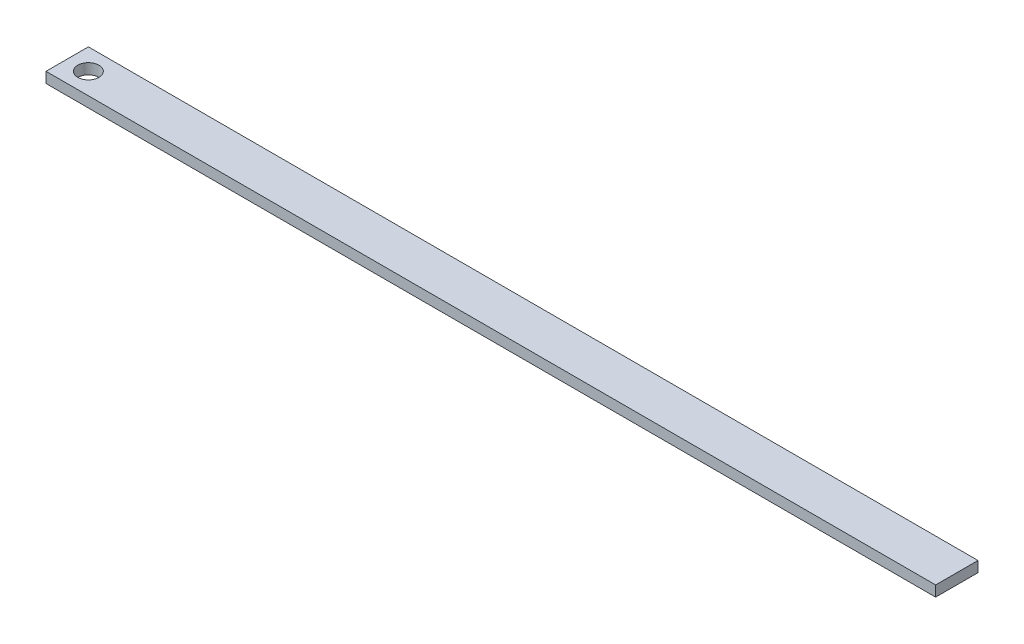
ISO-10303-21;
HEADER;
FILE_DESCRIPTION(('STEP AP214'),'2;1');
FILE_NAME('part.step','',(''),(''),'','','');
FILE_SCHEMA(('AUTOMOTIVE_DESIGN { 1 0 10303 214 1 1 1 1 }'));
ENDSEC;
DATA;
#1=APPLICATION_CONTEXT('core data for automotive mechanical design processes');
#2=APPLICATION_PROTOCOL_DEFINITION('international standard','automotive_design',2000,#1);
#3=PRODUCT_CONTEXT('',#1,'mechanical');
#4=PRODUCT('Part','Part','',(#3));
#5=PRODUCT_RELATED_PRODUCT_CATEGORY('part','',(#4));
#6=PRODUCT_DEFINITION_FORMATION('','',#4);
#7=PRODUCT_DEFINITION_CONTEXT('part definition',#1,'design');
#8=PRODUCT_DEFINITION('design','',#6,#7);
#9=PRODUCT_DEFINITION_SHAPE('','',#8);
#10=(LENGTH_UNIT() NAMED_UNIT(*) SI_UNIT(.MILLI.,.METRE.));
#11=(NAMED_UNIT(*) PLANE_ANGLE_UNIT() SI_UNIT($,.RADIAN.));
#12=(NAMED_UNIT(*) SI_UNIT($,.STERADIAN.) SOLID_ANGLE_UNIT());
#13=UNCERTAINTY_MEASURE_WITH_UNIT(LENGTH_MEASURE(1.E-05),#10,'distance_accuracy_value','');
#14=(GEOMETRIC_REPRESENTATION_CONTEXT(3) GLOBAL_UNCERTAINTY_ASSIGNED_CONTEXT((#13)) GLOBAL_UNIT_ASSIGNED_CONTEXT((#10,
#11,#12)) REPRESENTATION_CONTEXT('',''));
#15=CARTESIAN_POINT('',(0.,0.,0.));
#16=DIRECTION('',(0.,0.,1.));
#17=DIRECTION('',(1.,0.,0.));
#18=AXIS2_PLACEMENT_3D('',#15,#16,#17);
#19=CARTESIAN_POINT('',(10.5,0.25,0.499999999999996));
#20=DIRECTION('',(0.,1.,0.));
#21=DIRECTION('',(0.,0.,1.));
#22=AXIS2_PLACEMENT_3D('',#19,#20,#21);
#23=PLANE('',#22);
#24=DIRECTION('',(0.,0.,-1.));
#25=VECTOR('',#24,1.);
#26=CARTESIAN_POINT('',(10.5,0.25,-0.500000000000004));
#27=LINE('',#26,#25);
#28=CARTESIAN_POINT('',(10.5,0.25,0.499999999999996));
#29=VERTEX_POINT('',#28);
#30=CARTESIAN_POINT('',(10.5,0.25,-0.500000000000004));
#31=VERTEX_POINT('',#30);
#32=EDGE_CURVE('E90',#29,#31,#27,.T.);
#33=ORIENTED_EDGE('',*,*,#32,.T.);
#34=DIRECTION('',(-1.,0.,0.));
#35=VECTOR('',#34,1.);
#36=CARTESIAN_POINT('',(-10.5,0.25,-0.500000000000004));
#37=LINE('',#36,#35);
#38=CARTESIAN_POINT('',(-10.5,0.25,-0.500000000000004));
#39=VERTEX_POINT('',#38);
#40=EDGE_CURVE('E85',#31,#39,#37,.T.);
#41=ORIENTED_EDGE('',*,*,#40,.T.);
#42=DIRECTION('',(0.,0.,1.));
#43=VECTOR('',#42,1.);
#44=CARTESIAN_POINT('',(-10.5,0.25,-0.500000000000004));
#45=LINE('',#44,#43);
#46=CARTESIAN_POINT('',(-10.5,0.25,0.500000000000004));
#47=VERTEX_POINT('',#46);
#48=EDGE_CURVE('E88',#39,#47,#45,.T.);
#49=ORIENTED_EDGE('',*,*,#48,.T.);
#50=DIRECTION('',(1.,0.,0.));
#51=VECTOR('',#50,1.);
#52=CARTESIAN_POINT('',(-10.5,0.25,0.500000000000004));
#53=LINE('',#52,#51);
#54=EDGE_CURVE('E55',#47,#29,#53,.T.);
#55=ORIENTED_EDGE('',*,*,#54,.T.);
#56=EDGE_LOOP('',(#33,#41,#49,#55));
#57=FACE_BOUND('',#56,.T.);
#58=CARTESIAN_POINT('',(-9.99999999999999,0.25,0.));
#59=DIRECTION('',(0.,1.,0.));
#60=DIRECTION('',(0.,0.,1.));
#61=AXIS2_PLACEMENT_3D('',#58,#59,#60);
#62=CIRCLE('',#61,0.25);
#63=CARTESIAN_POINT('',(-9.99999999999999,0.25,0.25));
#64=VERTEX_POINT('',#63);
#65=EDGE_CURVE('E105',#64,#64,#62,.T.);
#66=ORIENTED_EDGE('',*,*,#65,.F.);
#67=EDGE_LOOP('',(#66));
#68=FACE_BOUND('',#67,.T.);
#69=ADVANCED_FACE('F38',(#57,#68),#23,.T.);
#70=CARTESIAN_POINT('',(10.5,0.,0.499999999999996));
#71=DIRECTION('',(0.,1.,0.));
#72=DIRECTION('',(0.,0.,1.));
#73=AXIS2_PLACEMENT_3D('',#70,#71,#72);
#74=PLANE('',#73);
#75=DIRECTION('',(0.,0.,-1.));
#76=VECTOR('',#75,1.);
#77=CARTESIAN_POINT('',(10.5,0.,-0.500000000000004));
#78=LINE('',#77,#76);
#79=CARTESIAN_POINT('',(10.5,0.,0.499999999999996));
#80=VERTEX_POINT('',#79);
#81=CARTESIAN_POINT('',(10.5,0.,-0.500000000000004));
#82=VERTEX_POINT('',#81);
#83=EDGE_CURVE('E102',#80,#82,#78,.T.);
#84=ORIENTED_EDGE('',*,*,#83,.F.);
#85=DIRECTION('',(1.,0.,0.));
#86=VECTOR('',#85,1.);
#87=CARTESIAN_POINT('',(-10.5,0.,0.500000000000004));
#88=LINE('',#87,#86);
#89=CARTESIAN_POINT('',(-10.5,0.,0.500000000000004));
#90=VERTEX_POINT('',#89);
#91=EDGE_CURVE('E78',#90,#80,#88,.T.);
#92=ORIENTED_EDGE('',*,*,#91,.F.);
#93=DIRECTION('',(0.,0.,1.));
#94=VECTOR('',#93,1.);
#95=CARTESIAN_POINT('',(-10.5,0.,-0.500000000000004));
#96=LINE('',#95,#94);
#97=CARTESIAN_POINT('',(-10.5,0.,-0.500000000000004));
#98=VERTEX_POINT('',#97);
#99=EDGE_CURVE('E72',#98,#90,#96,.T.);
#100=ORIENTED_EDGE('',*,*,#99,.F.);
#101=DIRECTION('',(-1.,0.,0.));
#102=VECTOR('',#101,1.);
#103=CARTESIAN_POINT('',(-10.5,0.,-0.500000000000004));
#104=LINE('',#103,#102);
#105=EDGE_CURVE('E94',#82,#98,#104,.T.);
#106=ORIENTED_EDGE('',*,*,#105,.F.);
#107=EDGE_LOOP('',(#84,#92,#100,#106));
#108=FACE_BOUND('',#107,.T.);
#109=CARTESIAN_POINT('',(-9.99999999999999,0.,0.));
#110=DIRECTION('',(0.,1.,0.));
#111=DIRECTION('',(0.,0.,1.));
#112=AXIS2_PLACEMENT_3D('',#109,#110,#111);
#113=CIRCLE('',#112,0.25);
#114=CARTESIAN_POINT('',(-9.99999999999999,0.,0.25));
#115=VERTEX_POINT('',#114);
#116=EDGE_CURVE('E117',#115,#115,#113,.T.);
#117=ORIENTED_EDGE('',*,*,#116,.T.);
#118=EDGE_LOOP('',(#117));
#119=FACE_BOUND('',#118,.T.);
#120=ADVANCED_FACE('F113',(#108,#119),#74,.F.);
#121=CARTESIAN_POINT('',(10.5,0.25,-0.500000000000004));
#122=DIRECTION('',(-1.,0.,0.));
#123=DIRECTION('',(0.,0.,1.));
#124=AXIS2_PLACEMENT_3D('',#121,#122,#123);
#125=PLANE('',#124);
#126=ORIENTED_EDGE('',*,*,#83,.T.);
#127=DIRECTION('',(0.,-1.,0.));
#128=VECTOR('',#127,1.);
#129=CARTESIAN_POINT('',(10.5,0.25,-0.500000000000004));
#130=LINE('',#129,#128);
#131=EDGE_CURVE('E11',#31,#82,#130,.T.);
#132=ORIENTED_EDGE('',*,*,#131,.F.);
#133=ORIENTED_EDGE('',*,*,#32,.F.);
#134=DIRECTION('',(0.,-1.,0.));
#135=VECTOR('',#134,1.);
#136=CARTESIAN_POINT('',(10.5,0.25,0.499999999999996));
#137=LINE('',#136,#135);
#138=EDGE_CURVE('E98',#29,#80,#137,.T.);
#139=ORIENTED_EDGE('',*,*,#138,.T.);
#140=EDGE_LOOP('',(#126,#132,#133,#139));
#141=FACE_BOUND('',#140,.T.);
#142=ADVANCED_FACE('F40',(#141),#125,.F.);
#143=CARTESIAN_POINT('',(-10.5,0.25,-0.500000000000004));
#144=DIRECTION('',(0.,0.,1.));
#145=DIRECTION('',(1.,0.,0.));
#146=AXIS2_PLACEMENT_3D('',#143,#144,#145);
#147=PLANE('',#146);
#148=ORIENTED_EDGE('',*,*,#105,.T.);
#149=DIRECTION('',(0.,-1.,0.));
#150=VECTOR('',#149,1.);
#151=CARTESIAN_POINT('',(-10.5,0.25,-0.500000000000004));
#152=LINE('',#151,#150);
#153=EDGE_CURVE('E47',#39,#98,#152,.T.);
#154=ORIENTED_EDGE('',*,*,#153,.F.);
#155=ORIENTED_EDGE('',*,*,#40,.F.);
#156=ORIENTED_EDGE('',*,*,#131,.T.);
#157=EDGE_LOOP('',(#148,#154,#155,#156));
#158=FACE_BOUND('',#157,.T.);
#159=ADVANCED_FACE('F93',(#158),#147,.F.);
#160=CARTESIAN_POINT('',(-10.5,0.25,-0.500000000000004));
#161=DIRECTION('',(1.,0.,0.));
#162=DIRECTION('',(0.,0.,-1.));
#163=AXIS2_PLACEMENT_3D('',#160,#161,#162);
#164=PLANE('',#163);
#165=ORIENTED_EDGE('',*,*,#99,.T.);
#166=DIRECTION('',(0.,-1.,0.));
#167=VECTOR('',#166,1.);
#168=CARTESIAN_POINT('',(-10.5,0.25,0.500000000000004));
#169=LINE('',#168,#167);
#170=EDGE_CURVE('E95',#47,#90,#169,.T.);
#171=ORIENTED_EDGE('',*,*,#170,.F.);
#172=ORIENTED_EDGE('',*,*,#48,.F.);
#173=ORIENTED_EDGE('',*,*,#153,.T.);
#174=EDGE_LOOP('',(#165,#171,#172,#173));
#175=FACE_BOUND('',#174,.T.);
#176=ADVANCED_FACE('F96',(#175),#164,.F.);
#177=CARTESIAN_POINT('',(-10.5,0.25,0.500000000000004));
#178=DIRECTION('',(0.,0.,-1.));
#179=DIRECTION('',(-1.,0.,0.));
#180=AXIS2_PLACEMENT_3D('',#177,#178,#179);
#181=PLANE('',#180);
#182=ORIENTED_EDGE('',*,*,#91,.T.);
#183=ORIENTED_EDGE('',*,*,#138,.F.);
#184=ORIENTED_EDGE('',*,*,#54,.F.);
#185=ORIENTED_EDGE('',*,*,#170,.T.);
#186=EDGE_LOOP('',(#182,#183,#184,#185));
#187=FACE_BOUND('',#186,.T.);
#188=ADVANCED_FACE('F110',(#187),#181,.F.);
#189=CARTESIAN_POINT('',(-9.99999999999999,0.25,0.));
#190=DIRECTION('',(0.,-1.,0.));
#191=DIRECTION('',(0.,0.,-1.));
#192=AXIS2_PLACEMENT_3D('',#189,#190,#191);
#193=CYLINDRICAL_SURFACE('',#192,0.25);
#194=ORIENTED_EDGE('',*,*,#65,.T.);
#195=EDGE_LOOP('',(#194));
#196=FACE_BOUND('',#195,.T.);
#197=ORIENTED_EDGE('',*,*,#116,.F.);
#198=EDGE_LOOP('',(#197));
#199=FACE_BOUND('',#198,.T.);
#200=ADVANCED_FACE('F123',(#196,#199),#193,.F.);
#201=CLOSED_SHELL('',(#69,#120,#142,#159,#176,#188,#200));
#202=MANIFOLD_SOLID_BREP('B2',#201);
#203=ADVANCED_BREP_SHAPE_REPRESENTATION('',(#18,#202),#14);
#204=SHAPE_DEFINITION_REPRESENTATION(#9,#203);
ENDSEC;
END-ISO-10303-21;
